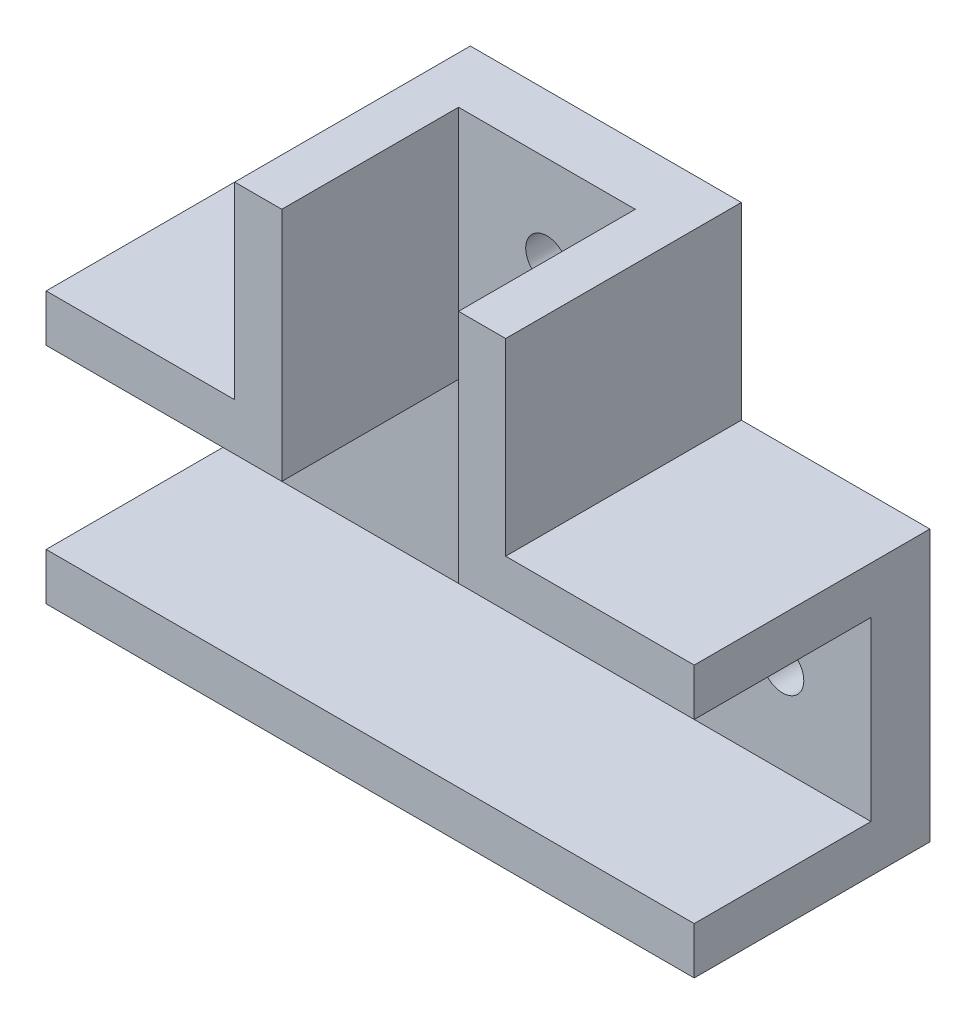
ISO-10303-21;
HEADER;
FILE_DESCRIPTION(('STEP AP214'),'2;1');
FILE_NAME('part.step','',(''),(''),'','','');
FILE_SCHEMA(('AUTOMOTIVE_DESIGN { 1 0 10303 214 1 1 1 1 }'));
ENDSEC;
DATA;
#1=APPLICATION_CONTEXT('core data for automotive mechanical design processes');
#2=APPLICATION_PROTOCOL_DEFINITION('international standard','automotive_design',2000,#1);
#3=PRODUCT_CONTEXT('',#1,'mechanical');
#4=PRODUCT('Part','Part','',(#3));
#5=PRODUCT_RELATED_PRODUCT_CATEGORY('part','',(#4));
#6=PRODUCT_DEFINITION_FORMATION('','',#4);
#7=PRODUCT_DEFINITION_CONTEXT('part definition',#1,'design');
#8=PRODUCT_DEFINITION('design','',#6,#7);
#9=PRODUCT_DEFINITION_SHAPE('','',#8);
#10=(LENGTH_UNIT() NAMED_UNIT(*) SI_UNIT(.MILLI.,.METRE.));
#11=(NAMED_UNIT(*) PLANE_ANGLE_UNIT() SI_UNIT($,.RADIAN.));
#12=(NAMED_UNIT(*) SI_UNIT($,.STERADIAN.) SOLID_ANGLE_UNIT());
#13=UNCERTAINTY_MEASURE_WITH_UNIT(LENGTH_MEASURE(1.E-05),#10,'distance_accuracy_value','');
#14=(GEOMETRIC_REPRESENTATION_CONTEXT(3) GLOBAL_UNCERTAINTY_ASSIGNED_CONTEXT((#13)) GLOBAL_UNIT_ASSIGNED_CONTEXT((#10,
#11,#12)) REPRESENTATION_CONTEXT('',''));
#15=CARTESIAN_POINT('',(0.,0.,0.));
#16=DIRECTION('',(0.,0.,1.));
#17=DIRECTION('',(1.,0.,0.));
#18=AXIS2_PLACEMENT_3D('',#15,#16,#17);
#19=CARTESIAN_POINT('',(-20.6862745098039,-4.26470588235294,5.));
#20=DIRECTION('',(1.,0.,0.));
#21=DIRECTION('',(0.,1.,0.));
#22=AXIS2_PLACEMENT_3D('',#19,#20,#21);
#23=PLANE('',#22);
#24=DIRECTION('',(0.,-1.,0.));
#25=VECTOR('',#24,1.);
#26=CARTESIAN_POINT('',(-20.6862745098039,-4.26470588235294,0.));
#27=LINE('',#26,#25);
#28=CARTESIAN_POINT('',(-20.6862745098039,-0.264705882352941,0.));
#29=VERTEX_POINT('',#28);
#30=CARTESIAN_POINT('',(-20.6862745098039,-23.2647058823529,0.));
#31=VERTEX_POINT('',#30);
#32=EDGE_CURVE('E248',#29,#31,#27,.T.);
#33=ORIENTED_EDGE('',*,*,#32,.T.);
#34=DIRECTION('',(0.,0.,-1.));
#35=VECTOR('',#34,1.);
#36=CARTESIAN_POINT('',(-20.6862745098039,-23.2647058823529,20.));
#37=LINE('',#36,#35);
#38=CARTESIAN_POINT('',(-20.6862745098039,-23.2647058823529,20.));
#39=VERTEX_POINT('',#38);
#40=EDGE_CURVE('E213',#39,#31,#37,.T.);
#41=ORIENTED_EDGE('',*,*,#40,.F.);
#42=DIRECTION('',(0.,1.,0.));
#43=VECTOR('',#42,1.);
#44=CARTESIAN_POINT('',(-20.6862745098039,-23.2647058823529,20.));
#45=LINE('',#44,#43);
#46=CARTESIAN_POINT('',(-20.6862745098039,-19.2647058823529,20.));
#47=VERTEX_POINT('',#46);
#48=EDGE_CURVE('E198',#39,#47,#45,.T.);
#49=ORIENTED_EDGE('',*,*,#48,.T.);
#50=DIRECTION('',(0.,0.,-1.));
#51=VECTOR('',#50,1.);
#52=CARTESIAN_POINT('',(-20.6862745098039,-19.2647058823529,20.));
#53=LINE('',#52,#51);
#54=CARTESIAN_POINT('',(-20.6862745098039,-19.2647058823529,5.));
#55=VERTEX_POINT('',#54);
#56=EDGE_CURVE('E210',#47,#55,#53,.T.);
#57=ORIENTED_EDGE('',*,*,#56,.T.);
#58=DIRECTION('',(0.,-1.,0.));
#59=VECTOR('',#58,1.);
#60=CARTESIAN_POINT('',(-20.6862745098039,-4.26470588235294,5.));
#61=LINE('',#60,#59);
#62=CARTESIAN_POINT('',(-20.6862745098039,-4.26470588235294,5.));
#63=VERTEX_POINT('',#62);
#64=EDGE_CURVE('E262',#63,#55,#61,.T.);
#65=ORIENTED_EDGE('',*,*,#64,.F.);
#66=DIRECTION('',(0.,0.,-1.));
#67=VECTOR('',#66,1.);
#68=CARTESIAN_POINT('',(-20.6862745098039,-4.26470588235294,20.));
#69=LINE('',#68,#67);
#70=CARTESIAN_POINT('',(-20.6862745098039,-4.26470588235294,20.));
#71=VERTEX_POINT('',#70);
#72=EDGE_CURVE('E245',#71,#63,#69,.T.);
#73=ORIENTED_EDGE('',*,*,#72,.F.);
#74=DIRECTION('',(0.,1.,0.));
#75=VECTOR('',#74,1.);
#76=CARTESIAN_POINT('',(-20.6862745098039,-4.26470588235294,20.));
#77=LINE('',#76,#75);
#78=CARTESIAN_POINT('',(-20.6862745098039,-0.264705882352941,20.));
#79=VERTEX_POINT('',#78);
#80=EDGE_CURVE('E224',#71,#79,#77,.T.);
#81=ORIENTED_EDGE('',*,*,#80,.T.);
#82=DIRECTION('',(0.,0.,-1.));
#83=VECTOR('',#82,1.);
#84=CARTESIAN_POINT('',(-20.6862745098039,-0.264705882352941,20.));
#85=LINE('',#84,#83);
#86=EDGE_CURVE('E240',#79,#29,#85,.T.);
#87=ORIENTED_EDGE('',*,*,#86,.T.);
#88=EDGE_LOOP('',(#33,#41,#49,#57,#65,#73,#81,#87));
#89=FACE_BOUND('',#88,.T.);
#90=ADVANCED_FACE('F33',(#89),#23,.F.);
#91=CARTESIAN_POINT('',(34.3137254901961,-4.26470588235294,5.));
#92=DIRECTION('',(-1.,0.,0.));
#93=DIRECTION('',(0.,0.,1.));
#94=AXIS2_PLACEMENT_3D('',#91,#92,#93);
#95=PLANE('',#94);
#96=DIRECTION('',(0.,1.,0.));
#97=VECTOR('',#96,1.);
#98=CARTESIAN_POINT('',(34.3137254901961,-4.26470588235294,0.));
#99=LINE('',#98,#97);
#100=CARTESIAN_POINT('',(34.3137254901961,-23.2647058823529,0.));
#101=VERTEX_POINT('',#100);
#102=CARTESIAN_POINT('',(34.3137254901961,-0.264705882352946,0.));
#103=VERTEX_POINT('',#102);
#104=EDGE_CURVE('E275',#101,#103,#99,.T.);
#105=ORIENTED_EDGE('',*,*,#104,.T.);
#106=DIRECTION('',(0.,0.,-1.));
#107=VECTOR('',#106,1.);
#108=CARTESIAN_POINT('',(34.3137254901961,-0.264705882352946,20.));
#109=LINE('',#108,#107);
#110=CARTESIAN_POINT('',(34.3137254901961,-0.264705882352946,20.));
#111=VERTEX_POINT('',#110);
#112=EDGE_CURVE('E161',#111,#103,#109,.T.);
#113=ORIENTED_EDGE('',*,*,#112,.F.);
#114=DIRECTION('',(0.,1.,0.));
#115=VECTOR('',#114,1.);
#116=CARTESIAN_POINT('',(34.3137254901961,-4.26470588235295,20.));
#117=LINE('',#116,#115);
#118=CARTESIAN_POINT('',(34.3137254901961,-4.26470588235295,20.));
#119=VERTEX_POINT('',#118);
#120=EDGE_CURVE('E158',#119,#111,#117,.T.);
#121=ORIENTED_EDGE('',*,*,#120,.F.);
#122=DIRECTION('',(0.,0.,-1.));
#123=VECTOR('',#122,1.);
#124=CARTESIAN_POINT('',(34.3137254901961,-4.26470588235295,20.));
#125=LINE('',#124,#123);
#126=CARTESIAN_POINT('',(34.3137254901961,-4.26470588235294,5.));
#127=VERTEX_POINT('',#126);
#128=EDGE_CURVE('E144',#119,#127,#125,.T.);
#129=ORIENTED_EDGE('',*,*,#128,.T.);
#130=DIRECTION('',(0.,1.,0.));
#131=VECTOR('',#130,1.);
#132=CARTESIAN_POINT('',(34.3137254901961,-4.26470588235294,5.));
#133=LINE('',#132,#131);
#134=CARTESIAN_POINT('',(34.3137254901961,-19.2647058823529,5.));
#135=VERTEX_POINT('',#134);
#136=EDGE_CURVE('E267',#135,#127,#133,.T.);
#137=ORIENTED_EDGE('',*,*,#136,.F.);
#138=DIRECTION('',(0.,0.,-1.));
#139=VECTOR('',#138,1.);
#140=CARTESIAN_POINT('',(34.3137254901961,-19.2647058823529,20.));
#141=LINE('',#140,#139);
#142=CARTESIAN_POINT('',(34.3137254901961,-19.2647058823529,20.));
#143=VERTEX_POINT('',#142);
#144=EDGE_CURVE('E220',#143,#135,#141,.T.);
#145=ORIENTED_EDGE('',*,*,#144,.F.);
#146=DIRECTION('',(0.,-1.,0.));
#147=VECTOR('',#146,1.);
#148=CARTESIAN_POINT('',(34.3137254901961,-19.2647058823529,20.));
#149=LINE('',#148,#147);
#150=CARTESIAN_POINT('',(34.3137254901961,-23.2647058823529,20.));
#151=VERTEX_POINT('',#150);
#152=EDGE_CURVE('E204',#143,#151,#149,.T.);
#153=ORIENTED_EDGE('',*,*,#152,.T.);
#154=DIRECTION('',(0.,0.,-1.));
#155=VECTOR('',#154,1.);
#156=CARTESIAN_POINT('',(34.3137254901961,-23.2647058823529,20.));
#157=LINE('',#156,#155);
#158=EDGE_CURVE('E217',#151,#101,#157,.T.);
#159=ORIENTED_EDGE('',*,*,#158,.T.);
#160=EDGE_LOOP('',(#105,#113,#121,#129,#137,#145,#153,#159));
#161=FACE_BOUND('',#160,.T.);
#162=ADVANCED_FACE('F159',(#161),#95,.F.);
#163=CARTESIAN_POINT('',(-0.686274509803913,15.7352941176471,5.));
#164=DIRECTION('',(0.,-1.,0.));
#165=DIRECTION('',(0.,0.,-1.));
#166=AXIS2_PLACEMENT_3D('',#163,#164,#165);
#167=PLANE('',#166);
#168=DIRECTION('',(-1.,0.,0.));
#169=VECTOR('',#168,1.);
#170=CARTESIAN_POINT('',(-0.686274509803913,15.7352941176471,0.));
#171=LINE('',#170,#169);
#172=CARTESIAN_POINT('',(18.3137254901961,15.7352941176471,0.));
#173=VERTEX_POINT('',#172);
#174=CARTESIAN_POINT('',(-4.68627450980391,15.7352941176471,0.));
#175=VERTEX_POINT('',#174);
#176=EDGE_CURVE('E36',#173,#175,#171,.T.);
#177=ORIENTED_EDGE('',*,*,#176,.T.);
#178=DIRECTION('',(0.,0.,-1.));
#179=VECTOR('',#178,1.);
#180=CARTESIAN_POINT('',(-4.68627450980391,15.7352941176471,20.));
#181=LINE('',#180,#179);
#182=CARTESIAN_POINT('',(-4.68627450980391,15.7352941176471,20.));
#183=VERTEX_POINT('',#182);
#184=EDGE_CURVE('E255',#183,#175,#181,.T.);
#185=ORIENTED_EDGE('',*,*,#184,.F.);
#186=DIRECTION('',(-1.,0.,0.));
#187=VECTOR('',#186,1.);
#188=CARTESIAN_POINT('',(-0.686274509803913,15.7352941176471,20.));
#189=LINE('',#188,#187);
#190=CARTESIAN_POINT('',(-0.686274509803913,15.7352941176471,20.));
#191=VERTEX_POINT('',#190);
#192=EDGE_CURVE('E233',#191,#183,#189,.T.);
#193=ORIENTED_EDGE('',*,*,#192,.F.);
#194=DIRECTION('',(0.,0.,-1.));
#195=VECTOR('',#194,1.);
#196=CARTESIAN_POINT('',(-0.686274509803913,15.7352941176471,20.));
#197=LINE('',#196,#195);
#198=CARTESIAN_POINT('',(-0.686274509803913,15.7352941176471,5.));
#199=VERTEX_POINT('',#198);
#200=EDGE_CURVE('E252',#191,#199,#197,.T.);
#201=ORIENTED_EDGE('',*,*,#200,.T.);
#202=DIRECTION('',(-1.,0.,0.));
#203=VECTOR('',#202,1.);
#204=CARTESIAN_POINT('',(-0.686274509803913,15.7352941176471,5.));
#205=LINE('',#204,#203);
#206=CARTESIAN_POINT('',(14.3137254901961,15.7352941176471,5.));
#207=VERTEX_POINT('',#206);
#208=EDGE_CURVE('E272',#207,#199,#205,.T.);
#209=ORIENTED_EDGE('',*,*,#208,.F.);
#210=DIRECTION('',(0.,0.,-1.));
#211=VECTOR('',#210,1.);
#212=CARTESIAN_POINT('',(14.3137254901961,15.7352941176471,20.));
#213=LINE('',#212,#211);
#214=CARTESIAN_POINT('',(14.3137254901961,15.7352941176471,20.));
#215=VERTEX_POINT('',#214);
#216=EDGE_CURVE('E194',#215,#207,#213,.T.);
#217=ORIENTED_EDGE('',*,*,#216,.F.);
#218=DIRECTION('',(1.,0.,0.));
#219=VECTOR('',#218,1.);
#220=CARTESIAN_POINT('',(14.3137254901961,15.7352941176471,20.));
#221=LINE('',#220,#219);
#222=CARTESIAN_POINT('',(18.3137254901961,15.7352941176471,20.));
#223=VERTEX_POINT('',#222);
#224=EDGE_CURVE('E171',#215,#223,#221,.T.);
#225=ORIENTED_EDGE('',*,*,#224,.T.);
#226=DIRECTION('',(0.,0.,-1.));
#227=VECTOR('',#226,1.);
#228=CARTESIAN_POINT('',(18.3137254901961,15.7352941176471,20.));
#229=LINE('',#228,#227);
#230=EDGE_CURVE('E191',#223,#173,#229,.T.);
#231=ORIENTED_EDGE('',*,*,#230,.T.);
#232=EDGE_LOOP('',(#177,#185,#193,#201,#209,#217,#225,#231));
#233=FACE_BOUND('',#232,.T.);
#234=ADVANCED_FACE('F279',(#233),#167,.F.);
#235=CARTESIAN_POINT('',(0.,0.,5.));
#236=DIRECTION('',(0.,0.,1.));
#237=DIRECTION('',(1.,0.,0.));
#238=AXIS2_PLACEMENT_3D('',#235,#236,#237);
#239=PLANE('',#238);
#240=CARTESIAN_POINT('',(6.81372549019609,8.23529411764706,5.));
#241=DIRECTION('',(0.,0.,1.));
#242=DIRECTION('',(1.,0.,0.));
#243=AXIS2_PLACEMENT_3D('',#240,#241,#242);
#244=CIRCLE('',#243,1.8);
#245=CARTESIAN_POINT('',(8.61372549019609,8.23529411764706,5.));
#246=VERTEX_POINT('',#245);
#247=EDGE_CURVE('E530',#246,#246,#244,.T.);
#248=ORIENTED_EDGE('',*,*,#247,.F.);
#249=EDGE_LOOP('',(#248));
#250=FACE_BOUND('',#249,.T.);
#251=CARTESIAN_POINT('',(-13.1862745098039,-11.7647058823529,5.));
#252=DIRECTION('',(0.,0.,1.));
#253=DIRECTION('',(1.,0.,0.));
#254=AXIS2_PLACEMENT_3D('',#251,#252,#253);
#255=CIRCLE('',#254,1.8);
#256=CARTESIAN_POINT('',(-11.3862745098039,-11.7647058823529,5.));
#257=VERTEX_POINT('',#256);
#258=EDGE_CURVE('E535',#257,#257,#255,.T.);
#259=ORIENTED_EDGE('',*,*,#258,.F.);
#260=EDGE_LOOP('',(#259));
#261=FACE_BOUND('',#260,.T.);
#262=CARTESIAN_POINT('',(26.8137254901961,-11.7647058823529,5.));
#263=DIRECTION('',(0.,0.,1.));
#264=DIRECTION('',(1.,0.,0.));
#265=AXIS2_PLACEMENT_3D('',#262,#263,#264);
#266=CIRCLE('',#265,1.8);
#267=CARTESIAN_POINT('',(28.6137254901961,-11.7647058823529,5.));
#268=VERTEX_POINT('',#267);
#269=EDGE_CURVE('E542',#268,#268,#266,.T.);
#270=ORIENTED_EDGE('',*,*,#269,.F.);
#271=EDGE_LOOP('',(#270));
#272=FACE_BOUND('',#271,.T.);
#273=ORIENTED_EDGE('',*,*,#64,.T.);
#274=DIRECTION('',(1.,0.,0.));
#275=VECTOR('',#274,1.);
#276=CARTESIAN_POINT('',(-20.6862745098039,-19.2647058823529,5.));
#277=LINE('',#276,#275);
#278=EDGE_CURVE('E264',#55,#135,#277,.T.);
#279=ORIENTED_EDGE('',*,*,#278,.T.);
#280=ORIENTED_EDGE('',*,*,#136,.T.);
#281=DIRECTION('',(-1.,0.,0.));
#282=VECTOR('',#281,1.);
#283=CARTESIAN_POINT('',(14.3137254901961,-4.26470588235294,5.));
#284=LINE('',#283,#282);
#285=CARTESIAN_POINT('',(14.3137254901961,-4.26470588235294,5.));
#286=VERTEX_POINT('',#285);
#287=EDGE_CURVE('E150',#127,#286,#284,.T.);
#288=ORIENTED_EDGE('',*,*,#287,.T.);
#289=DIRECTION('',(0.,1.,0.));
#290=VECTOR('',#289,1.);
#291=CARTESIAN_POINT('',(14.3137254901961,15.7352941176471,5.));
#292=LINE('',#291,#290);
#293=EDGE_CURVE('E270',#286,#207,#292,.T.);
#294=ORIENTED_EDGE('',*,*,#293,.T.);
#295=ORIENTED_EDGE('',*,*,#208,.T.);
#296=DIRECTION('',(0.,-1.,0.));
#297=VECTOR('',#296,1.);
#298=CARTESIAN_POINT('',(-0.686274509803913,15.7352941176471,5.));
#299=LINE('',#298,#297);
#300=CARTESIAN_POINT('',(-0.68627450980391,-4.26470588235294,5.));
#301=VERTEX_POINT('',#300);
#302=EDGE_CURVE('E41',#199,#301,#299,.T.);
#303=ORIENTED_EDGE('',*,*,#302,.T.);
#304=DIRECTION('',(-1.,0.,0.));
#305=VECTOR('',#304,1.);
#306=CARTESIAN_POINT('',(-20.6862745098039,-4.26470588235294,5.));
#307=LINE('',#306,#305);
#308=EDGE_CURVE('E11',#301,#63,#307,.T.);
#309=ORIENTED_EDGE('',*,*,#308,.T.);
#310=EDGE_LOOP('',(#273,#279,#280,#288,#294,#295,#303,#309));
#311=FACE_BOUND('',#310,.T.);
#312=ADVANCED_FACE('F312',(#250,#261,#272,#311),#239,.T.);
#313=CARTESIAN_POINT('',(0.,0.,0.));
#314=DIRECTION('',(0.,0.,1.));
#315=DIRECTION('',(1.,0.,0.));
#316=AXIS2_PLACEMENT_3D('',#313,#314,#315);
#317=PLANE('',#316);
#318=CARTESIAN_POINT('',(6.81372549019609,8.23529411764706,0.));
#319=DIRECTION('',(0.,0.,1.));
#320=DIRECTION('',(1.,0.,0.));
#321=AXIS2_PLACEMENT_3D('',#318,#319,#320);
#322=CIRCLE('',#321,1.8);
#323=CARTESIAN_POINT('',(8.61372549019609,8.23529411764706,0.));
#324=VERTEX_POINT('',#323);
#325=EDGE_CURVE('E184',#324,#324,#322,.T.);
#326=ORIENTED_EDGE('',*,*,#325,.T.);
#327=EDGE_LOOP('',(#326));
#328=FACE_BOUND('',#327,.T.);
#329=CARTESIAN_POINT('',(-13.1862745098039,-11.7647058823529,0.));
#330=DIRECTION('',(0.,0.,1.));
#331=DIRECTION('',(1.,0.,0.));
#332=AXIS2_PLACEMENT_3D('',#329,#330,#331);
#333=CIRCLE('',#332,1.8);
#334=CARTESIAN_POINT('',(-11.3862745098039,-11.7647058823529,0.));
#335=VERTEX_POINT('',#334);
#336=EDGE_CURVE('E531',#335,#335,#333,.T.);
#337=ORIENTED_EDGE('',*,*,#336,.T.);
#338=EDGE_LOOP('',(#337));
#339=FACE_BOUND('',#338,.T.);
#340=CARTESIAN_POINT('',(26.8137254901961,-11.7647058823529,0.));
#341=DIRECTION('',(0.,0.,1.));
#342=DIRECTION('',(1.,0.,0.));
#343=AXIS2_PLACEMENT_3D('',#340,#341,#342);
#344=CIRCLE('',#343,1.8);
#345=CARTESIAN_POINT('',(28.6137254901961,-11.7647058823529,0.));
#346=VERTEX_POINT('',#345);
#347=EDGE_CURVE('E540',#346,#346,#344,.T.);
#348=ORIENTED_EDGE('',*,*,#347,.T.);
#349=EDGE_LOOP('',(#348));
#350=FACE_BOUND('',#349,.T.);
#351=ORIENTED_EDGE('',*,*,#176,.F.);
#352=DIRECTION('',(0.,-1.,0.));
#353=VECTOR('',#352,1.);
#354=CARTESIAN_POINT('',(18.3137254901961,15.7352941176471,0.));
#355=LINE('',#354,#353);
#356=CARTESIAN_POINT('',(18.3137254901961,-0.264705882352947,0.));
#357=VERTEX_POINT('',#356);
#358=EDGE_CURVE('E181',#173,#357,#355,.T.);
#359=ORIENTED_EDGE('',*,*,#358,.T.);
#360=DIRECTION('',(-1.,0.,0.));
#361=VECTOR('',#360,1.);
#362=CARTESIAN_POINT('',(34.3137254901961,-0.264705882352946,0.));
#363=LINE('',#362,#361);
#364=EDGE_CURVE('E163',#103,#357,#363,.T.);
#365=ORIENTED_EDGE('',*,*,#364,.F.);
#366=ORIENTED_EDGE('',*,*,#104,.F.);
#367=DIRECTION('',(-1.,0.,0.));
#368=VECTOR('',#367,1.);
#369=CARTESIAN_POINT('',(34.3137254901961,-23.2647058823529,0.));
#370=LINE('',#369,#368);
#371=EDGE_CURVE('E187',#101,#31,#370,.T.);
#372=ORIENTED_EDGE('',*,*,#371,.T.);
#373=ORIENTED_EDGE('',*,*,#32,.F.);
#374=DIRECTION('',(1.,0.,0.));
#375=VECTOR('',#374,1.);
#376=CARTESIAN_POINT('',(-6.07997052750672,-0.264705882352943,0.));
#377=LINE('',#376,#375);
#378=CARTESIAN_POINT('',(-4.68627450980391,-0.264705882352945,0.));
#379=VERTEX_POINT('',#378);
#380=EDGE_CURVE('E216',#29,#379,#377,.T.);
#381=ORIENTED_EDGE('',*,*,#380,.T.);
#382=DIRECTION('',(0.,-1.,0.));
#383=VECTOR('',#382,1.);
#384=CARTESIAN_POINT('',(-4.68627450980391,15.7352941176471,0.));
#385=LINE('',#384,#383);
#386=EDGE_CURVE('E228',#175,#379,#385,.T.);
#387=ORIENTED_EDGE('',*,*,#386,.F.);
#388=EDGE_LOOP('',(#351,#359,#365,#366,#372,#373,#381,#387));
#389=FACE_BOUND('',#388,.T.);
#390=ADVANCED_FACE('F288',(#328,#339,#350,#389),#317,.F.);
#391=CARTESIAN_POINT('',(-20.6862745098039,-4.26470588235294,20.));
#392=DIRECTION('',(0.,1.,0.));
#393=DIRECTION('',(-1.,0.,0.));
#394=AXIS2_PLACEMENT_3D('',#391,#392,#393);
#395=PLANE('',#394);
#396=ORIENTED_EDGE('',*,*,#308,.F.);
#397=DIRECTION('',(0.,0.,-1.));
#398=VECTOR('',#397,1.);
#399=CARTESIAN_POINT('',(-0.686274509803916,-4.26470588235294,20.));
#400=LINE('',#399,#398);
#401=CARTESIAN_POINT('',(-0.686274509803916,-4.26470588235294,20.));
#402=VERTEX_POINT('',#401);
#403=EDGE_CURVE('E249',#402,#301,#400,.T.);
#404=ORIENTED_EDGE('',*,*,#403,.F.);
#405=DIRECTION('',(1.,0.,0.));
#406=VECTOR('',#405,1.);
#407=CARTESIAN_POINT('',(-20.6862745098039,-4.26470588235294,20.));
#408=LINE('',#407,#406);
#409=EDGE_CURVE('E238',#71,#402,#408,.T.);
#410=ORIENTED_EDGE('',*,*,#409,.F.);
#411=ORIENTED_EDGE('',*,*,#72,.T.);
#412=EDGE_LOOP('',(#396,#404,#410,#411));
#413=FACE_BOUND('',#412,.T.);
#414=ADVANCED_FACE('F304',(#413),#395,.F.);
#415=CARTESIAN_POINT('',(-0.686274509803913,15.7352941176471,20.));
#416=DIRECTION('',(1.,0.,0.));
#417=DIRECTION('',(0.,1.,0.));
#418=AXIS2_PLACEMENT_3D('',#415,#416,#417);
#419=PLANE('',#418);
#420=ORIENTED_EDGE('',*,*,#403,.T.);
#421=ORIENTED_EDGE('',*,*,#302,.F.);
#422=ORIENTED_EDGE('',*,*,#200,.F.);
#423=DIRECTION('',(0.,-1.,0.));
#424=VECTOR('',#423,1.);
#425=CARTESIAN_POINT('',(-0.686274509803913,15.7352941176471,20.));
#426=LINE('',#425,#424);
#427=EDGE_CURVE('E235',#191,#402,#426,.T.);
#428=ORIENTED_EDGE('',*,*,#427,.T.);
#429=EDGE_LOOP('',(#420,#421,#422,#428));
#430=FACE_BOUND('',#429,.T.);
#431=ADVANCED_FACE('F302',(#430),#419,.T.);
#432=CARTESIAN_POINT('',(-4.68627450980391,15.7352941176471,20.));
#433=DIRECTION('',(1.,0.,0.));
#434=DIRECTION('',(0.,1.,0.));
#435=AXIS2_PLACEMENT_3D('',#432,#433,#434);
#436=PLANE('',#435);
#437=ORIENTED_EDGE('',*,*,#386,.T.);
#438=DIRECTION('',(0.,0.,-1.));
#439=VECTOR('',#438,1.);
#440=CARTESIAN_POINT('',(-4.68627450980391,-0.264705882352945,20.));
#441=LINE('',#440,#439);
#442=CARTESIAN_POINT('',(-4.68627450980391,-0.264705882352945,20.));
#443=VERTEX_POINT('',#442);
#444=EDGE_CURVE('E258',#443,#379,#441,.T.);
#445=ORIENTED_EDGE('',*,*,#444,.F.);
#446=DIRECTION('',(0.,-1.,0.));
#447=VECTOR('',#446,1.);
#448=CARTESIAN_POINT('',(-4.68627450980391,15.7352941176471,20.));
#449=LINE('',#448,#447);
#450=EDGE_CURVE('E230',#183,#443,#449,.T.);
#451=ORIENTED_EDGE('',*,*,#450,.F.);
#452=ORIENTED_EDGE('',*,*,#184,.T.);
#453=EDGE_LOOP('',(#437,#445,#451,#452));
#454=FACE_BOUND('',#453,.T.);
#455=ADVANCED_FACE('F286',(#454),#436,.F.);
#456=CARTESIAN_POINT('',(-6.07997052750672,-0.264705882352943,20.));
#457=DIRECTION('',(0.,1.,0.));
#458=DIRECTION('',(-1.,0.,0.));
#459=AXIS2_PLACEMENT_3D('',#456,#457,#458);
#460=PLANE('',#459);
#461=ORIENTED_EDGE('',*,*,#380,.F.);
#462=ORIENTED_EDGE('',*,*,#86,.F.);
#463=DIRECTION('',(1.,0.,0.));
#464=VECTOR('',#463,1.);
#465=CARTESIAN_POINT('',(-20.6862745098039,-0.264705882352941,20.));
#466=LINE('',#465,#464);
#467=EDGE_CURVE('E227',#79,#443,#466,.T.);
#468=ORIENTED_EDGE('',*,*,#467,.T.);
#469=ORIENTED_EDGE('',*,*,#444,.T.);
#470=EDGE_LOOP('',(#461,#462,#468,#469));
#471=FACE_BOUND('',#470,.T.);
#472=ADVANCED_FACE('F291',(#471),#460,.T.);
#473=CARTESIAN_POINT('',(0.,0.,20.));
#474=DIRECTION('',(0.,0.,-1.));
#475=DIRECTION('',(-1.,0.,0.));
#476=AXIS2_PLACEMENT_3D('',#473,#474,#475);
#477=PLANE('',#476);
#478=ORIENTED_EDGE('',*,*,#80,.F.);
#479=ORIENTED_EDGE('',*,*,#409,.T.);
#480=ORIENTED_EDGE('',*,*,#427,.F.);
#481=ORIENTED_EDGE('',*,*,#192,.T.);
#482=ORIENTED_EDGE('',*,*,#450,.T.);
#483=ORIENTED_EDGE('',*,*,#467,.F.);
#484=EDGE_LOOP('',(#478,#479,#480,#481,#482,#483));
#485=FACE_BOUND('',#484,.T.);
#486=ADVANCED_FACE('F297',(#485),#477,.F.);
#487=CARTESIAN_POINT('',(-20.6862745098039,-19.2647058823529,20.));
#488=DIRECTION('',(0.,1.,0.));
#489=DIRECTION('',(0.,0.,1.));
#490=AXIS2_PLACEMENT_3D('',#487,#488,#489);
#491=PLANE('',#490);
#492=ORIENTED_EDGE('',*,*,#278,.F.);
#493=ORIENTED_EDGE('',*,*,#56,.F.);
#494=DIRECTION('',(1.,0.,0.));
#495=VECTOR('',#494,1.);
#496=CARTESIAN_POINT('',(-20.6862745098039,-19.2647058823529,20.));
#497=LINE('',#496,#495);
#498=EDGE_CURVE('E201',#47,#143,#497,.T.);
#499=ORIENTED_EDGE('',*,*,#498,.T.);
#500=ORIENTED_EDGE('',*,*,#144,.T.);
#501=EDGE_LOOP('',(#492,#493,#499,#500));
#502=FACE_BOUND('',#501,.T.);
#503=ADVANCED_FACE('F345',(#502),#491,.T.);
#504=CARTESIAN_POINT('',(34.3137254901961,-23.2647058823529,20.));
#505=DIRECTION('',(0.,-1.,0.));
#506=DIRECTION('',(0.,0.,-1.));
#507=AXIS2_PLACEMENT_3D('',#504,#505,#506);
#508=PLANE('',#507);
#509=ORIENTED_EDGE('',*,*,#371,.F.);
#510=ORIENTED_EDGE('',*,*,#158,.F.);
#511=DIRECTION('',(-1.,0.,0.));
#512=VECTOR('',#511,1.);
#513=CARTESIAN_POINT('',(34.3137254901961,-23.2647058823529,20.));
#514=LINE('',#513,#512);
#515=EDGE_CURVE('E207',#151,#39,#514,.T.);
#516=ORIENTED_EDGE('',*,*,#515,.T.);
#517=ORIENTED_EDGE('',*,*,#40,.T.);
#518=EDGE_LOOP('',(#509,#510,#516,#517));
#519=FACE_BOUND('',#518,.T.);
#520=ADVANCED_FACE('F351',(#519),#508,.T.);
#521=CARTESIAN_POINT('',(0.,0.,20.));
#522=DIRECTION('',(0.,0.,-1.));
#523=DIRECTION('',(-1.,0.,0.));
#524=AXIS2_PLACEMENT_3D('',#521,#522,#523);
#525=PLANE('',#524);
#526=ORIENTED_EDGE('',*,*,#48,.F.);
#527=ORIENTED_EDGE('',*,*,#515,.F.);
#528=ORIENTED_EDGE('',*,*,#152,.F.);
#529=ORIENTED_EDGE('',*,*,#498,.F.);
#530=EDGE_LOOP('',(#526,#527,#528,#529));
#531=FACE_BOUND('',#530,.T.);
#532=ADVANCED_FACE('F359',(#531),#525,.F.);
#533=CARTESIAN_POINT('',(34.3137254901961,-0.264705882352946,20.));
#534=DIRECTION('',(0.,-1.,0.));
#535=DIRECTION('',(1.,0.,0.));
#536=AXIS2_PLACEMENT_3D('',#533,#534,#535);
#537=PLANE('',#536);
#538=ORIENTED_EDGE('',*,*,#364,.T.);
#539=DIRECTION('',(0.,0.,-1.));
#540=VECTOR('',#539,1.);
#541=CARTESIAN_POINT('',(18.3137254901961,-0.264705882352947,20.));
#542=LINE('',#541,#540);
#543=CARTESIAN_POINT('',(18.3137254901961,-0.264705882352947,20.));
#544=VERTEX_POINT('',#543);
#545=EDGE_CURVE('E188',#544,#357,#542,.T.);
#546=ORIENTED_EDGE('',*,*,#545,.F.);
#547=DIRECTION('',(-1.,0.,0.));
#548=VECTOR('',#547,1.);
#549=CARTESIAN_POINT('',(19.7074215078989,-0.264705882352945,20.));
#550=LINE('',#549,#548);
#551=EDGE_CURVE('E154',#111,#544,#550,.T.);
#552=ORIENTED_EDGE('',*,*,#551,.F.);
#553=ORIENTED_EDGE('',*,*,#112,.T.);
#554=EDGE_LOOP('',(#538,#546,#552,#553));
#555=FACE_BOUND('',#554,.T.);
#556=ADVANCED_FACE('F367',(#555),#537,.F.);
#557=CARTESIAN_POINT('',(18.3137254901961,15.7352941176471,20.));
#558=DIRECTION('',(1.,0.,0.));
#559=DIRECTION('',(0.,1.,0.));
#560=AXIS2_PLACEMENT_3D('',#557,#558,#559);
#561=PLANE('',#560);
#562=ORIENTED_EDGE('',*,*,#358,.F.);
#563=ORIENTED_EDGE('',*,*,#230,.F.);
#564=DIRECTION('',(0.,-1.,0.));
#565=VECTOR('',#564,1.);
#566=CARTESIAN_POINT('',(18.3137254901961,15.7352941176471,20.));
#567=LINE('',#566,#565);
#568=EDGE_CURVE('E177',#223,#544,#567,.T.);
#569=ORIENTED_EDGE('',*,*,#568,.T.);
#570=ORIENTED_EDGE('',*,*,#545,.T.);
#571=EDGE_LOOP('',(#562,#563,#569,#570));
#572=FACE_BOUND('',#571,.T.);
#573=ADVANCED_FACE('F375',(#572),#561,.T.);
#574=CARTESIAN_POINT('',(14.3137254901961,15.7352941176471,20.));
#575=DIRECTION('',(1.,0.,0.));
#576=DIRECTION('',(0.,1.,0.));
#577=AXIS2_PLACEMENT_3D('',#574,#575,#576);
#578=PLANE('',#577);
#579=ORIENTED_EDGE('',*,*,#293,.F.);
#580=DIRECTION('',(0.,0.,-1.));
#581=VECTOR('',#580,1.);
#582=CARTESIAN_POINT('',(14.3137254901961,-4.26470588235295,20.));
#583=LINE('',#582,#581);
#584=CARTESIAN_POINT('',(14.3137254901961,-4.26470588235295,20.));
#585=VERTEX_POINT('',#584);
#586=EDGE_CURVE('E153',#585,#286,#583,.T.);
#587=ORIENTED_EDGE('',*,*,#586,.F.);
#588=DIRECTION('',(0.,-1.,0.));
#589=VECTOR('',#588,1.);
#590=CARTESIAN_POINT('',(14.3137254901961,15.7352941176471,20.));
#591=LINE('',#590,#589);
#592=EDGE_CURVE('E168',#215,#585,#591,.T.);
#593=ORIENTED_EDGE('',*,*,#592,.F.);
#594=ORIENTED_EDGE('',*,*,#216,.T.);
#595=EDGE_LOOP('',(#579,#587,#593,#594));
#596=FACE_BOUND('',#595,.T.);
#597=ADVANCED_FACE('F384',(#596),#578,.F.);
#598=CARTESIAN_POINT('',(34.3137254901961,-4.26470588235295,20.));
#599=DIRECTION('',(0.,-1.,0.));
#600=DIRECTION('',(1.,0.,0.));
#601=AXIS2_PLACEMENT_3D('',#598,#599,#600);
#602=PLANE('',#601);
#603=ORIENTED_EDGE('',*,*,#586,.T.);
#604=ORIENTED_EDGE('',*,*,#287,.F.);
#605=ORIENTED_EDGE('',*,*,#128,.F.);
#606=DIRECTION('',(-1.,0.,0.));
#607=VECTOR('',#606,1.);
#608=CARTESIAN_POINT('',(34.3137254901961,-4.26470588235295,20.));
#609=LINE('',#608,#607);
#610=EDGE_CURVE('E149',#119,#585,#609,.T.);
#611=ORIENTED_EDGE('',*,*,#610,.T.);
#612=EDGE_LOOP('',(#603,#604,#605,#611));
#613=FACE_BOUND('',#612,.T.);
#614=ADVANCED_FACE('F147',(#613),#602,.T.);
#615=CARTESIAN_POINT('',(13.6274509803922,0.,20.));
#616=DIRECTION('',(0.,0.,-1.));
#617=DIRECTION('',(1.,0.,0.));
#618=AXIS2_PLACEMENT_3D('',#615,#616,#617);
#619=PLANE('',#618);
#620=ORIENTED_EDGE('',*,*,#120,.T.);
#621=ORIENTED_EDGE('',*,*,#551,.T.);
#622=ORIENTED_EDGE('',*,*,#568,.F.);
#623=ORIENTED_EDGE('',*,*,#224,.F.);
#624=ORIENTED_EDGE('',*,*,#592,.T.);
#625=ORIENTED_EDGE('',*,*,#610,.F.);
#626=EDGE_LOOP('',(#620,#621,#622,#623,#624,#625));
#627=FACE_BOUND('',#626,.T.);
#628=ADVANCED_FACE('F165',(#627),#619,.F.);
#629=CARTESIAN_POINT('',(26.8137254901961,-11.7647058823529,0.));
#630=DIRECTION('',(0.,0.,1.));
#631=DIRECTION('',(1.,0.,0.));
#632=AXIS2_PLACEMENT_3D('',#629,#630,#631);
#633=CYLINDRICAL_SURFACE('',#632,1.8);
#634=ORIENTED_EDGE('',*,*,#347,.F.);
#635=EDGE_LOOP('',(#634));
#636=FACE_BOUND('',#635,.T.);
#637=ORIENTED_EDGE('',*,*,#269,.T.);
#638=EDGE_LOOP('',(#637));
#639=FACE_BOUND('',#638,.T.);
#640=ADVANCED_FACE('F405',(#636,#639),#633,.F.);
#641=CARTESIAN_POINT('',(-13.1862745098039,-11.7647058823529,0.));
#642=DIRECTION('',(0.,0.,1.));
#643=DIRECTION('',(1.,0.,0.));
#644=AXIS2_PLACEMENT_3D('',#641,#642,#643);
#645=CYLINDRICAL_SURFACE('',#644,1.8);
#646=ORIENTED_EDGE('',*,*,#336,.F.);
#647=EDGE_LOOP('',(#646));
#648=FACE_BOUND('',#647,.T.);
#649=ORIENTED_EDGE('',*,*,#258,.T.);
#650=EDGE_LOOP('',(#649));
#651=FACE_BOUND('',#650,.T.);
#652=ADVANCED_FACE('F413',(#648,#651),#645,.F.);
#653=CARTESIAN_POINT('',(6.81372549019609,8.23529411764706,0.));
#654=DIRECTION('',(0.,0.,1.));
#655=DIRECTION('',(1.,0.,0.));
#656=AXIS2_PLACEMENT_3D('',#653,#654,#655);
#657=CYLINDRICAL_SURFACE('',#656,1.8);
#658=ORIENTED_EDGE('',*,*,#325,.F.);
#659=EDGE_LOOP('',(#658));
#660=FACE_BOUND('',#659,.T.);
#661=ORIENTED_EDGE('',*,*,#247,.T.);
#662=EDGE_LOOP('',(#661));
#663=FACE_BOUND('',#662,.T.);
#664=ADVANCED_FACE('F422',(#660,#663),#657,.F.);
#665=CLOSED_SHELL('',(#90,#162,#234,#312,#390,#414,#431,#455,#472,#486,#503,#520,#532,#556,#573,
#597,#614,#628,#640,#652,#664));
#666=MANIFOLD_SOLID_BREP('B2',#665);
#667=ADVANCED_BREP_SHAPE_REPRESENTATION('',(#18,#666),#14);
#668=SHAPE_DEFINITION_REPRESENTATION(#9,#667);
ENDSEC;
END-ISO-10303-21;
